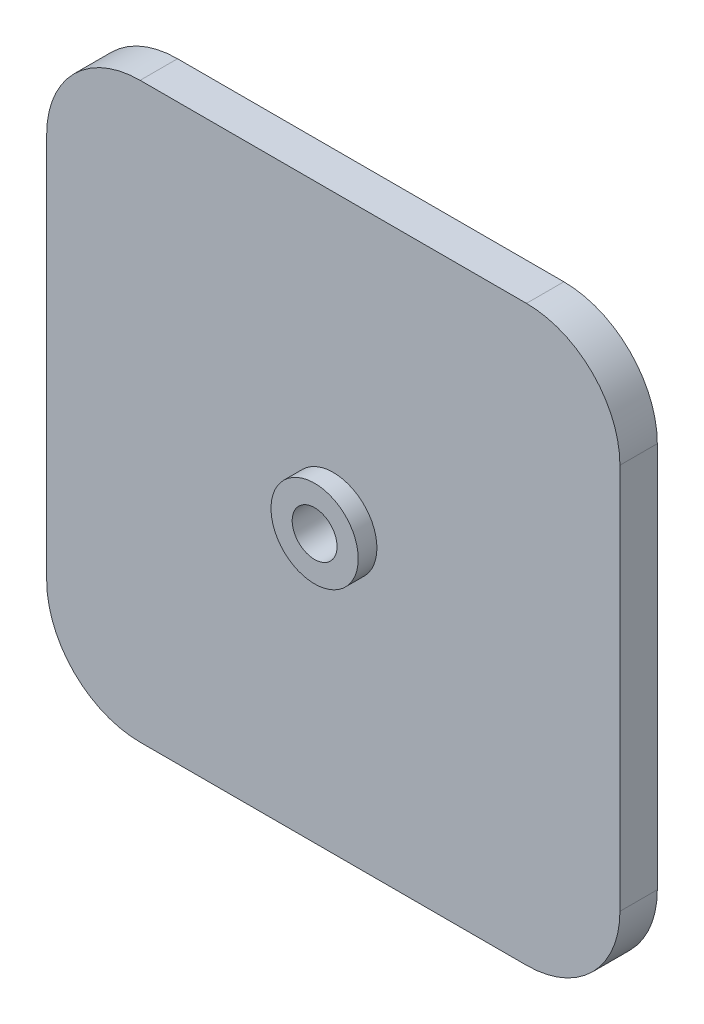
ISO-10303-21;
HEADER;
FILE_DESCRIPTION(('STEP AP214'),'2;1');
FILE_NAME('part.step','',(''),(''),'','','');
FILE_SCHEMA(('AUTOMOTIVE_DESIGN { 1 0 10303 214 1 1 1 1 }'));
ENDSEC;
DATA;
#1=APPLICATION_CONTEXT('core data for automotive mechanical design processes');
#2=APPLICATION_PROTOCOL_DEFINITION('international standard','automotive_design',2000,#1);
#3=PRODUCT_CONTEXT('',#1,'mechanical');
#4=PRODUCT('Part','Part','',(#3));
#5=PRODUCT_RELATED_PRODUCT_CATEGORY('part','',(#4));
#6=PRODUCT_DEFINITION_FORMATION('','',#4);
#7=PRODUCT_DEFINITION_CONTEXT('part definition',#1,'design');
#8=PRODUCT_DEFINITION('design','',#6,#7);
#9=PRODUCT_DEFINITION_SHAPE('','',#8);
#10=(LENGTH_UNIT() NAMED_UNIT(*) SI_UNIT(.MILLI.,.METRE.));
#11=(NAMED_UNIT(*) PLANE_ANGLE_UNIT() SI_UNIT($,.RADIAN.));
#12=(NAMED_UNIT(*) SI_UNIT($,.STERADIAN.) SOLID_ANGLE_UNIT());
#13=UNCERTAINTY_MEASURE_WITH_UNIT(LENGTH_MEASURE(1.E-05),#10,'distance_accuracy_value','');
#14=(GEOMETRIC_REPRESENTATION_CONTEXT(3) GLOBAL_UNCERTAINTY_ASSIGNED_CONTEXT((#13)) GLOBAL_UNIT_ASSIGNED_CONTEXT((#10,
#11,#12)) REPRESENTATION_CONTEXT('',''));
#15=CARTESIAN_POINT('',(0.,0.,0.));
#16=DIRECTION('',(0.,0.,1.));
#17=DIRECTION('',(1.,0.,0.));
#18=AXIS2_PLACEMENT_3D('',#15,#16,#17);
#19=CARTESIAN_POINT('',(-15.5,-15.5,3.));
#20=DIRECTION('',(0.,0.,-1.));
#21=DIRECTION('',(-1.,0.,0.));
#22=AXIS2_PLACEMENT_3D('',#19,#20,#21);
#23=CYLINDRICAL_SURFACE('',#22,7.5);
#24=CARTESIAN_POINT('',(-15.5,-15.5,0.));
#25=DIRECTION('',(0.,0.,1.));
#26=DIRECTION('',(1.,0.,0.));
#27=AXIS2_PLACEMENT_3D('',#24,#25,#26);
#28=CIRCLE('',#27,7.5);
#29=CARTESIAN_POINT('',(-23.,-15.5,0.));
#30=VERTEX_POINT('',#29);
#31=CARTESIAN_POINT('',(-15.5,-23.,0.));
#32=VERTEX_POINT('',#31);
#33=EDGE_CURVE('E129',#30,#32,#28,.T.);
#34=ORIENTED_EDGE('',*,*,#33,.T.);
#35=DIRECTION('',(0.,0.,-1.));
#36=VECTOR('',#35,1.);
#37=CARTESIAN_POINT('',(-15.5,-23.,3.));
#38=LINE('',#37,#36);
#39=CARTESIAN_POINT('',(-15.5,-23.,3.));
#40=VERTEX_POINT('',#39);
#41=EDGE_CURVE('E11',#40,#32,#38,.T.);
#42=ORIENTED_EDGE('',*,*,#41,.F.);
#43=CARTESIAN_POINT('',(-15.5,-15.5,3.));
#44=DIRECTION('',(0.,0.,1.));
#45=DIRECTION('',(1.,0.,0.));
#46=AXIS2_PLACEMENT_3D('',#43,#44,#45);
#47=CIRCLE('',#46,7.5);
#48=CARTESIAN_POINT('',(-23.,-15.5,3.));
#49=VERTEX_POINT('',#48);
#50=EDGE_CURVE('E144',#49,#40,#47,.T.);
#51=ORIENTED_EDGE('',*,*,#50,.F.);
#52=DIRECTION('',(0.,0.,-1.));
#53=VECTOR('',#52,1.);
#54=CARTESIAN_POINT('',(-23.,-15.5,3.));
#55=LINE('',#54,#53);
#56=EDGE_CURVE('E125',#49,#30,#55,.T.);
#57=ORIENTED_EDGE('',*,*,#56,.T.);
#58=EDGE_LOOP('',(#34,#42,#51,#57));
#59=FACE_BOUND('',#58,.T.);
#60=ADVANCED_FACE('F33',(#59),#23,.T.);
#61=CARTESIAN_POINT('',(-15.5,-23.,3.));
#62=DIRECTION('',(0.,1.,0.));
#63=DIRECTION('',(0.,0.,1.));
#64=AXIS2_PLACEMENT_3D('',#61,#62,#63);
#65=PLANE('',#64);
#66=DIRECTION('',(1.,0.,0.));
#67=VECTOR('',#66,1.);
#68=CARTESIAN_POINT('',(-15.5,-23.,0.));
#69=LINE('',#68,#67);
#70=CARTESIAN_POINT('',(15.5,-23.,0.));
#71=VERTEX_POINT('',#70);
#72=EDGE_CURVE('E132',#32,#71,#69,.T.);
#73=ORIENTED_EDGE('',*,*,#72,.T.);
#74=DIRECTION('',(0.,0.,-1.));
#75=VECTOR('',#74,1.);
#76=CARTESIAN_POINT('',(15.5,-23.,3.));
#77=LINE('',#76,#75);
#78=CARTESIAN_POINT('',(15.5,-23.,3.));
#79=VERTEX_POINT('',#78);
#80=EDGE_CURVE('E41',#79,#71,#77,.T.);
#81=ORIENTED_EDGE('',*,*,#80,.F.);
#82=DIRECTION('',(1.,0.,0.));
#83=VECTOR('',#82,1.);
#84=CARTESIAN_POINT('',(-15.5,-23.,3.));
#85=LINE('',#84,#83);
#86=EDGE_CURVE('E92',#40,#79,#85,.T.);
#87=ORIENTED_EDGE('',*,*,#86,.F.);
#88=ORIENTED_EDGE('',*,*,#41,.T.);
#89=EDGE_LOOP('',(#73,#81,#87,#88));
#90=FACE_BOUND('',#89,.T.);
#91=ADVANCED_FACE('F214',(#90),#65,.F.);
#92=CARTESIAN_POINT('',(15.5,-15.5,3.));
#93=DIRECTION('',(0.,0.,-1.));
#94=DIRECTION('',(-1.,0.,0.));
#95=AXIS2_PLACEMENT_3D('',#92,#93,#94);
#96=CYLINDRICAL_SURFACE('',#95,7.5);
#97=CARTESIAN_POINT('',(15.5,-15.5,0.));
#98=DIRECTION('',(0.,0.,1.));
#99=DIRECTION('',(1.,0.,0.));
#100=AXIS2_PLACEMENT_3D('',#97,#98,#99);
#101=CIRCLE('',#100,7.5);
#102=CARTESIAN_POINT('',(23.,-15.5,0.));
#103=VERTEX_POINT('',#102);
#104=EDGE_CURVE('E135',#71,#103,#101,.T.);
#105=ORIENTED_EDGE('',*,*,#104,.T.);
#106=DIRECTION('',(0.,0.,-1.));
#107=VECTOR('',#106,1.);
#108=CARTESIAN_POINT('',(23.,-15.5,3.));
#109=LINE('',#108,#107);
#110=CARTESIAN_POINT('',(23.,-15.5,3.));
#111=VERTEX_POINT('',#110);
#112=EDGE_CURVE('E151',#111,#103,#109,.T.);
#113=ORIENTED_EDGE('',*,*,#112,.F.);
#114=CARTESIAN_POINT('',(15.5,-15.5,3.));
#115=DIRECTION('',(0.,0.,1.));
#116=DIRECTION('',(1.,0.,0.));
#117=AXIS2_PLACEMENT_3D('',#114,#115,#116);
#118=CIRCLE('',#117,7.5);
#119=EDGE_CURVE('E159',#79,#111,#118,.T.);
#120=ORIENTED_EDGE('',*,*,#119,.F.);
#121=ORIENTED_EDGE('',*,*,#80,.T.);
#122=EDGE_LOOP('',(#105,#113,#120,#121));
#123=FACE_BOUND('',#122,.T.);
#124=ADVANCED_FACE('F157',(#123),#96,.T.);
#125=CARTESIAN_POINT('',(23.,15.5,3.));
#126=DIRECTION('',(-1.,0.,0.));
#127=DIRECTION('',(0.,-1.,0.));
#128=AXIS2_PLACEMENT_3D('',#125,#126,#127);
#129=PLANE('',#128);
#130=DIRECTION('',(0.,1.,0.));
#131=VECTOR('',#130,1.);
#132=CARTESIAN_POINT('',(23.,15.5,0.));
#133=LINE('',#132,#131);
#134=CARTESIAN_POINT('',(23.,15.5,0.));
#135=VERTEX_POINT('',#134);
#136=EDGE_CURVE('E137',#103,#135,#133,.T.);
#137=ORIENTED_EDGE('',*,*,#136,.T.);
#138=DIRECTION('',(0.,0.,-1.));
#139=VECTOR('',#138,1.);
#140=CARTESIAN_POINT('',(23.,15.5,3.));
#141=LINE('',#140,#139);
#142=CARTESIAN_POINT('',(23.,15.5,3.));
#143=VERTEX_POINT('',#142);
#144=EDGE_CURVE('E148',#143,#135,#141,.T.);
#145=ORIENTED_EDGE('',*,*,#144,.F.);
#146=DIRECTION('',(0.,1.,0.));
#147=VECTOR('',#146,1.);
#148=CARTESIAN_POINT('',(23.,15.5,3.));
#149=LINE('',#148,#147);
#150=EDGE_CURVE('E171',#111,#143,#149,.T.);
#151=ORIENTED_EDGE('',*,*,#150,.F.);
#152=ORIENTED_EDGE('',*,*,#112,.T.);
#153=EDGE_LOOP('',(#137,#145,#151,#152));
#154=FACE_BOUND('',#153,.T.);
#155=ADVANCED_FACE('F167',(#154),#129,.F.);
#156=CARTESIAN_POINT('',(15.5,15.5,3.));
#157=DIRECTION('',(0.,0.,-1.));
#158=DIRECTION('',(-1.,0.,0.));
#159=AXIS2_PLACEMENT_3D('',#156,#157,#158);
#160=CYLINDRICAL_SURFACE('',#159,7.5);
#161=CARTESIAN_POINT('',(15.5,15.5,0.));
#162=DIRECTION('',(0.,0.,1.));
#163=DIRECTION('',(-1.,0.,0.));
#164=AXIS2_PLACEMENT_3D('',#161,#162,#163);
#165=CIRCLE('',#164,7.5);
#166=CARTESIAN_POINT('',(15.5,23.,0.));
#167=VERTEX_POINT('',#166);
#168=EDGE_CURVE('E139',#135,#167,#165,.T.);
#169=ORIENTED_EDGE('',*,*,#168,.T.);
#170=DIRECTION('',(0.,0.,-1.));
#171=VECTOR('',#170,1.);
#172=CARTESIAN_POINT('',(15.5,23.,3.));
#173=LINE('',#172,#171);
#174=CARTESIAN_POINT('',(15.5,23.,3.));
#175=VERTEX_POINT('',#174);
#176=EDGE_CURVE('E120',#175,#167,#173,.T.);
#177=ORIENTED_EDGE('',*,*,#176,.F.);
#178=CARTESIAN_POINT('',(15.5,15.5,3.));
#179=DIRECTION('',(0.,0.,1.));
#180=DIRECTION('',(-1.,0.,0.));
#181=AXIS2_PLACEMENT_3D('',#178,#179,#180);
#182=CIRCLE('',#181,7.5);
#183=EDGE_CURVE('E111',#143,#175,#182,.T.);
#184=ORIENTED_EDGE('',*,*,#183,.F.);
#185=ORIENTED_EDGE('',*,*,#144,.T.);
#186=EDGE_LOOP('',(#169,#177,#184,#185));
#187=FACE_BOUND('',#186,.T.);
#188=ADVANCED_FACE('F170',(#187),#160,.T.);
#189=CARTESIAN_POINT('',(-15.5,23.,3.));
#190=DIRECTION('',(0.,-1.,0.));
#191=DIRECTION('',(0.,0.,-1.));
#192=AXIS2_PLACEMENT_3D('',#189,#190,#191);
#193=PLANE('',#192);
#194=DIRECTION('',(-1.,0.,0.));
#195=VECTOR('',#194,1.);
#196=CARTESIAN_POINT('',(-15.5,23.,0.));
#197=LINE('',#196,#195);
#198=CARTESIAN_POINT('',(-15.5,23.,0.));
#199=VERTEX_POINT('',#198);
#200=EDGE_CURVE('E119',#167,#199,#197,.T.);
#201=ORIENTED_EDGE('',*,*,#200,.T.);
#202=DIRECTION('',(0.,0.,-1.));
#203=VECTOR('',#202,1.);
#204=CARTESIAN_POINT('',(-15.5,23.,3.));
#205=LINE('',#204,#203);
#206=CARTESIAN_POINT('',(-15.5,23.,3.));
#207=VERTEX_POINT('',#206);
#208=EDGE_CURVE('E116',#207,#199,#205,.T.);
#209=ORIENTED_EDGE('',*,*,#208,.F.);
#210=DIRECTION('',(-1.,0.,0.));
#211=VECTOR('',#210,1.);
#212=CARTESIAN_POINT('',(-15.5,23.,3.));
#213=LINE('',#212,#211);
#214=EDGE_CURVE('E105',#175,#207,#213,.T.);
#215=ORIENTED_EDGE('',*,*,#214,.F.);
#216=ORIENTED_EDGE('',*,*,#176,.T.);
#217=EDGE_LOOP('',(#201,#209,#215,#216));
#218=FACE_BOUND('',#217,.T.);
#219=ADVANCED_FACE('F117',(#218),#193,.F.);
#220=CARTESIAN_POINT('',(-15.5,15.5,3.));
#221=DIRECTION('',(0.,0.,-1.));
#222=DIRECTION('',(-1.,0.,0.));
#223=AXIS2_PLACEMENT_3D('',#220,#221,#222);
#224=CYLINDRICAL_SURFACE('',#223,7.5);
#225=CARTESIAN_POINT('',(-15.5,15.5,0.));
#226=DIRECTION('',(0.,0.,1.));
#227=DIRECTION('',(1.,0.,0.));
#228=AXIS2_PLACEMENT_3D('',#225,#226,#227);
#229=CIRCLE('',#228,7.5);
#230=CARTESIAN_POINT('',(-23.,15.5,0.));
#231=VERTEX_POINT('',#230);
#232=EDGE_CURVE('E78',#199,#231,#229,.T.);
#233=ORIENTED_EDGE('',*,*,#232,.T.);
#234=DIRECTION('',(0.,0.,-1.));
#235=VECTOR('',#234,1.);
#236=CARTESIAN_POINT('',(-23.,15.5,3.));
#237=LINE('',#236,#235);
#238=CARTESIAN_POINT('',(-23.,15.5,3.));
#239=VERTEX_POINT('',#238);
#240=EDGE_CURVE('E121',#239,#231,#237,.T.);
#241=ORIENTED_EDGE('',*,*,#240,.F.);
#242=CARTESIAN_POINT('',(-15.5,15.5,3.));
#243=DIRECTION('',(0.,0.,1.));
#244=DIRECTION('',(1.,0.,0.));
#245=AXIS2_PLACEMENT_3D('',#242,#243,#244);
#246=CIRCLE('',#245,7.5);
#247=EDGE_CURVE('E109',#207,#239,#246,.T.);
#248=ORIENTED_EDGE('',*,*,#247,.F.);
#249=ORIENTED_EDGE('',*,*,#208,.T.);
#250=EDGE_LOOP('',(#233,#241,#248,#249));
#251=FACE_BOUND('',#250,.T.);
#252=ADVANCED_FACE('F123',(#251),#224,.T.);
#253=CARTESIAN_POINT('',(-23.,15.5,3.));
#254=DIRECTION('',(1.,0.,0.));
#255=DIRECTION('',(0.,1.,0.));
#256=AXIS2_PLACEMENT_3D('',#253,#254,#255);
#257=PLANE('',#256);
#258=DIRECTION('',(0.,-1.,0.));
#259=VECTOR('',#258,1.);
#260=CARTESIAN_POINT('',(-23.,15.5,0.));
#261=LINE('',#260,#259);
#262=EDGE_CURVE('E84',#231,#30,#261,.T.);
#263=ORIENTED_EDGE('',*,*,#262,.T.);
#264=ORIENTED_EDGE('',*,*,#56,.F.);
#265=DIRECTION('',(0.,-1.,0.));
#266=VECTOR('',#265,1.);
#267=CARTESIAN_POINT('',(-23.,15.5,3.));
#268=LINE('',#267,#266);
#269=EDGE_CURVE('E49',#239,#49,#268,.T.);
#270=ORIENTED_EDGE('',*,*,#269,.F.);
#271=ORIENTED_EDGE('',*,*,#240,.T.);
#272=EDGE_LOOP('',(#263,#264,#270,#271));
#273=FACE_BOUND('',#272,.T.);
#274=ADVANCED_FACE('F204',(#273),#257,.F.);
#275=CARTESIAN_POINT('',(-15.5,-15.5,3.));
#276=DIRECTION('',(0.,0.,1.));
#277=DIRECTION('',(1.,0.,0.));
#278=AXIS2_PLACEMENT_3D('',#275,#276,#277);
#279=PLANE('',#278);
#280=CARTESIAN_POINT('',(0.,0.,3.));
#281=DIRECTION('',(0.,0.,1.));
#282=DIRECTION('',(1.,0.,0.));
#283=AXIS2_PLACEMENT_3D('',#280,#281,#282);
#284=CIRCLE('',#283,3.5);
#285=CARTESIAN_POINT('',(3.5,0.,3.));
#286=VERTEX_POINT('',#285);
#287=EDGE_CURVE('E177',#286,#286,#284,.T.);
#288=ORIENTED_EDGE('',*,*,#287,.F.);
#289=EDGE_LOOP('',(#288));
#290=FACE_BOUND('',#289,.T.);
#291=ORIENTED_EDGE('',*,*,#50,.T.);
#292=ORIENTED_EDGE('',*,*,#86,.T.);
#293=ORIENTED_EDGE('',*,*,#119,.T.);
#294=ORIENTED_EDGE('',*,*,#150,.T.);
#295=ORIENTED_EDGE('',*,*,#183,.T.);
#296=ORIENTED_EDGE('',*,*,#214,.T.);
#297=ORIENTED_EDGE('',*,*,#247,.T.);
#298=ORIENTED_EDGE('',*,*,#269,.T.);
#299=EDGE_LOOP('',(#291,#292,#293,#294,#295,#296,#297,#298));
#300=FACE_BOUND('',#299,.T.);
#301=ADVANCED_FACE('F107',(#290,#300),#279,.T.);
#302=CARTESIAN_POINT('',(-15.5,-15.5,0.));
#303=DIRECTION('',(0.,0.,1.));
#304=DIRECTION('',(1.,0.,0.));
#305=AXIS2_PLACEMENT_3D('',#302,#303,#304);
#306=PLANE('',#305);
#307=CARTESIAN_POINT('',(0.,0.,0.));
#308=DIRECTION('',(0.,0.,1.));
#309=DIRECTION('',(1.,0.,0.));
#310=AXIS2_PLACEMENT_3D('',#307,#308,#309);
#311=CIRCLE('',#310,1.8);
#312=CARTESIAN_POINT('',(1.8,0.,0.));
#313=VERTEX_POINT('',#312);
#314=EDGE_CURVE('E180',#313,#313,#311,.T.);
#315=ORIENTED_EDGE('',*,*,#314,.T.);
#316=EDGE_LOOP('',(#315));
#317=FACE_BOUND('',#316,.T.);
#318=ORIENTED_EDGE('',*,*,#33,.F.);
#319=ORIENTED_EDGE('',*,*,#262,.F.);
#320=ORIENTED_EDGE('',*,*,#232,.F.);
#321=ORIENTED_EDGE('',*,*,#200,.F.);
#322=ORIENTED_EDGE('',*,*,#168,.F.);
#323=ORIENTED_EDGE('',*,*,#136,.F.);
#324=ORIENTED_EDGE('',*,*,#104,.F.);
#325=ORIENTED_EDGE('',*,*,#72,.F.);
#326=EDGE_LOOP('',(#318,#319,#320,#321,#322,#323,#324,#325));
#327=FACE_BOUND('',#326,.T.);
#328=ADVANCED_FACE('F163',(#317,#327),#306,.F.);
#329=CARTESIAN_POINT('',(0.,0.,4.5));
#330=DIRECTION('',(0.,0.,-1.));
#331=DIRECTION('',(-1.,0.,0.));
#332=AXIS2_PLACEMENT_3D('',#329,#330,#331);
#333=CYLINDRICAL_SURFACE('',#332,3.5);
#334=CARTESIAN_POINT('',(0.,0.,4.5));
#335=DIRECTION('',(0.,0.,1.));
#336=DIRECTION('',(1.,0.,0.));
#337=AXIS2_PLACEMENT_3D('',#334,#335,#336);
#338=CIRCLE('',#337,3.5);
#339=CARTESIAN_POINT('',(3.5,0.,4.5));
#340=VERTEX_POINT('',#339);
#341=EDGE_CURVE('E133',#340,#340,#338,.T.);
#342=ORIENTED_EDGE('',*,*,#341,.F.);
#343=EDGE_LOOP('',(#342));
#344=FACE_BOUND('',#343,.T.);
#345=ORIENTED_EDGE('',*,*,#287,.T.);
#346=EDGE_LOOP('',(#345));
#347=FACE_BOUND('',#346,.T.);
#348=ADVANCED_FACE('F194',(#344,#347),#333,.T.);
#349=CARTESIAN_POINT('',(0.,0.,4.5));
#350=DIRECTION('',(0.,0.,1.));
#351=DIRECTION('',(1.,0.,0.));
#352=AXIS2_PLACEMENT_3D('',#349,#350,#351);
#353=PLANE('',#352);
#354=CARTESIAN_POINT('',(0.,0.,4.5));
#355=DIRECTION('',(0.,0.,1.));
#356=DIRECTION('',(1.,0.,0.));
#357=AXIS2_PLACEMENT_3D('',#354,#355,#356);
#358=CIRCLE('',#357,1.79999999999999);
#359=CARTESIAN_POINT('',(1.79999999999999,0.,4.5));
#360=VERTEX_POINT('',#359);
#361=EDGE_CURVE('E185',#360,#360,#358,.T.);
#362=ORIENTED_EDGE('',*,*,#361,.F.);
#363=EDGE_LOOP('',(#362));
#364=FACE_BOUND('',#363,.T.);
#365=ORIENTED_EDGE('',*,*,#341,.T.);
#366=EDGE_LOOP('',(#365));
#367=FACE_BOUND('',#366,.T.);
#368=ADVANCED_FACE('F191',(#364,#367),#353,.T.);
#369=CARTESIAN_POINT('',(0.,0.,4.5));
#370=DIRECTION('',(0.,0.,1.));
#371=DIRECTION('',(1.,0.,0.));
#372=AXIS2_PLACEMENT_3D('',#369,#370,#371);
#373=CYLINDRICAL_SURFACE('',#372,1.79999999999999);
#374=ORIENTED_EDGE('',*,*,#314,.F.);
#375=EDGE_LOOP('',(#374));
#376=FACE_BOUND('',#375,.T.);
#377=ORIENTED_EDGE('',*,*,#361,.T.);
#378=EDGE_LOOP('',(#377));
#379=FACE_BOUND('',#378,.T.);
#380=ADVANCED_FACE('F189',(#376,#379),#373,.F.);
#381=CLOSED_SHELL('',(#60,#91,#124,#155,#188,#219,#252,#274,#301,#328,#348,#368,#380));
#382=MANIFOLD_SOLID_BREP('B2',#381);
#383=ADVANCED_BREP_SHAPE_REPRESENTATION('',(#18,#382),#14);
#384=SHAPE_DEFINITION_REPRESENTATION(#9,#383);
ENDSEC;
END-ISO-10303-21;
